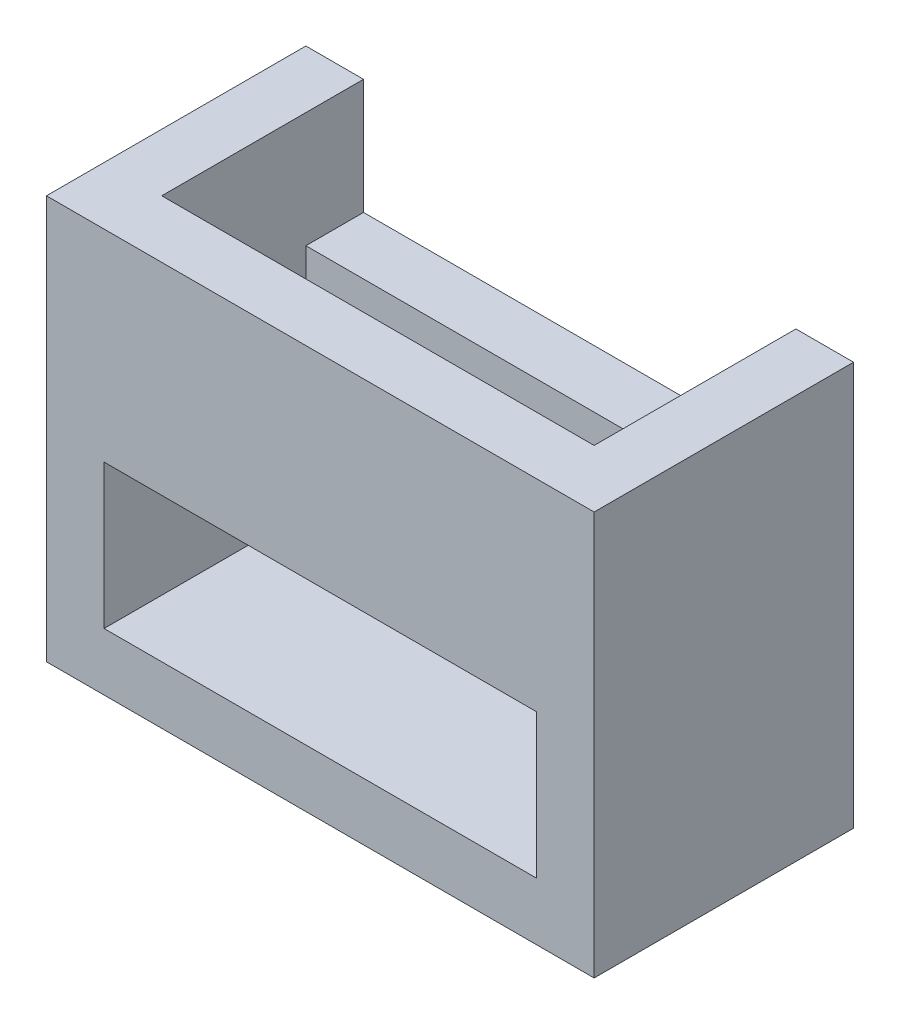
ISO-10303-21;
HEADER;
FILE_DESCRIPTION(('STEP AP214'),'2;1');
FILE_NAME('part.step','',(''),(''),'','','');
FILE_SCHEMA(('AUTOMOTIVE_DESIGN { 1 0 10303 214 1 1 1 1 }'));
ENDSEC;
DATA;
#1=APPLICATION_CONTEXT('core data for automotive mechanical design processes');
#2=APPLICATION_PROTOCOL_DEFINITION('international standard','automotive_design',2000,#1);
#3=PRODUCT_CONTEXT('',#1,'mechanical');
#4=PRODUCT('Part','Part','',(#3));
#5=PRODUCT_RELATED_PRODUCT_CATEGORY('part','',(#4));
#6=PRODUCT_DEFINITION_FORMATION('','',#4);
#7=PRODUCT_DEFINITION_CONTEXT('part definition',#1,'design');
#8=PRODUCT_DEFINITION('design','',#6,#7);
#9=PRODUCT_DEFINITION_SHAPE('','',#8);
#10=(LENGTH_UNIT() NAMED_UNIT(*) SI_UNIT(.MILLI.,.METRE.));
#11=(NAMED_UNIT(*) PLANE_ANGLE_UNIT() SI_UNIT($,.RADIAN.));
#12=(NAMED_UNIT(*) SI_UNIT($,.STERADIAN.) SOLID_ANGLE_UNIT());
#13=UNCERTAINTY_MEASURE_WITH_UNIT(LENGTH_MEASURE(1.E-05),#10,'distance_accuracy_value','');
#14=(GEOMETRIC_REPRESENTATION_CONTEXT(3) GLOBAL_UNCERTAINTY_ASSIGNED_CONTEXT((#13)) GLOBAL_UNIT_ASSIGNED_CONTEXT((#10,
#11,#12)) REPRESENTATION_CONTEXT('',''));
#15=CARTESIAN_POINT('',(0.,0.,0.));
#16=DIRECTION('',(0.,0.,1.));
#17=DIRECTION('',(1.,0.,0.));
#18=AXIS2_PLACEMENT_3D('',#15,#16,#17);
#19=CARTESIAN_POINT('',(0.,0.,4.));
#20=DIRECTION('',(0.,0.,1.));
#21=DIRECTION('',(1.,0.,0.));
#22=AXIS2_PLACEMENT_3D('',#19,#20,#21);
#23=PLANE('',#22);
#24=DIRECTION('',(0.,1.,0.));
#25=VECTOR('',#24,1.);
#26=CARTESIAN_POINT('',(7.50000000000001,0.,4.));
#27=LINE('',#26,#25);
#28=CARTESIAN_POINT('',(7.50000000000001,-5.,4.));
#29=VERTEX_POINT('',#28);
#30=CARTESIAN_POINT('',(7.50000000000001,-0.999999999999999,4.));
#31=VERTEX_POINT('',#30);
#32=EDGE_CURVE('E194',#29,#31,#27,.T.);
#33=ORIENTED_EDGE('',*,*,#32,.T.);
#34=DIRECTION('',(-1.,0.,0.));
#35=VECTOR('',#34,1.);
#36=CARTESIAN_POINT('',(0.,-0.999999999999999,4.));
#37=LINE('',#36,#35);
#38=CARTESIAN_POINT('',(-7.49999999999999,-0.999999999999999,4.));
#39=VERTEX_POINT('',#38);
#40=EDGE_CURVE('E12',#31,#39,#37,.T.);
#41=ORIENTED_EDGE('',*,*,#40,.T.);
#42=DIRECTION('',(0.,1.,0.));
#43=VECTOR('',#42,1.);
#44=CARTESIAN_POINT('',(-7.49999999999999,0.,4.));
#45=LINE('',#44,#43);
#46=CARTESIAN_POINT('',(-7.49999999999999,-5.,4.));
#47=VERTEX_POINT('',#46);
#48=EDGE_CURVE('E197',#47,#39,#45,.T.);
#49=ORIENTED_EDGE('',*,*,#48,.F.);
#50=DIRECTION('',(1.,0.,0.));
#51=VECTOR('',#50,1.);
#52=CARTESIAN_POINT('',(0.,-5.,4.));
#53=LINE('',#52,#51);
#54=EDGE_CURVE('E191',#47,#29,#53,.T.);
#55=ORIENTED_EDGE('',*,*,#54,.T.);
#56=EDGE_LOOP('',(#33,#41,#49,#55));
#57=FACE_BOUND('',#56,.T.);
#58=ADVANCED_FACE('F42',(#57),#23,.T.);
#59=CARTESIAN_POINT('',(-9.49999999999999,7.,9.));
#60=DIRECTION('',(0.,-1.,0.));
#61=DIRECTION('',(0.,0.,-1.));
#62=AXIS2_PLACEMENT_3D('',#59,#60,#61);
#63=PLANE('',#62);
#64=DIRECTION('',(0.,0.,-1.));
#65=VECTOR('',#64,1.);
#66=CARTESIAN_POINT('',(-7.49999999999999,7.,0.));
#67=LINE('',#66,#65);
#68=CARTESIAN_POINT('',(-7.49999999999999,7.,7.));
#69=VERTEX_POINT('',#68);
#70=CARTESIAN_POINT('',(-7.49999999999999,7.,0.));
#71=VERTEX_POINT('',#70);
#72=EDGE_CURVE('E170',#69,#71,#67,.T.);
#73=ORIENTED_EDGE('',*,*,#72,.T.);
#74=DIRECTION('',(-1.,0.,0.));
#75=VECTOR('',#74,1.);
#76=CARTESIAN_POINT('',(-9.49999999999999,7.,0.));
#77=LINE('',#76,#75);
#78=CARTESIAN_POINT('',(-9.49999999999999,7.,0.));
#79=VERTEX_POINT('',#78);
#80=EDGE_CURVE('E232',#71,#79,#77,.T.);
#81=ORIENTED_EDGE('',*,*,#80,.T.);
#82=DIRECTION('',(0.,0.,-1.));
#83=VECTOR('',#82,1.);
#84=CARTESIAN_POINT('',(-9.49999999999999,7.,9.));
#85=LINE('',#84,#83);
#86=CARTESIAN_POINT('',(-9.49999999999999,7.,9.));
#87=VERTEX_POINT('',#86);
#88=EDGE_CURVE('E244',#87,#79,#85,.T.);
#89=ORIENTED_EDGE('',*,*,#88,.F.);
#90=DIRECTION('',(-1.,0.,0.));
#91=VECTOR('',#90,1.);
#92=CARTESIAN_POINT('',(-9.49999999999999,7.,9.));
#93=LINE('',#92,#91);
#94=CARTESIAN_POINT('',(9.50000000000001,7.,9.));
#95=VERTEX_POINT('',#94);
#96=EDGE_CURVE('E222',#95,#87,#93,.T.);
#97=ORIENTED_EDGE('',*,*,#96,.F.);
#98=DIRECTION('',(0.,0.,-1.));
#99=VECTOR('',#98,1.);
#100=CARTESIAN_POINT('',(9.50000000000001,7.,9.));
#101=LINE('',#100,#99);
#102=CARTESIAN_POINT('',(9.50000000000001,7.,0.));
#103=VERTEX_POINT('',#102);
#104=EDGE_CURVE('E50',#95,#103,#101,.T.);
#105=ORIENTED_EDGE('',*,*,#104,.T.);
#106=CARTESIAN_POINT('',(7.50000000000001,7.,0.));
#107=VERTEX_POINT('',#106);
#108=EDGE_CURVE('E233',#103,#107,#77,.T.);
#109=ORIENTED_EDGE('',*,*,#108,.T.);
#110=DIRECTION('',(0.,0.,-1.));
#111=VECTOR('',#110,1.);
#112=CARTESIAN_POINT('',(7.50000000000001,7.,0.));
#113=LINE('',#112,#111);
#114=CARTESIAN_POINT('',(7.50000000000001,7.,7.));
#115=VERTEX_POINT('',#114);
#116=EDGE_CURVE('E178',#115,#107,#113,.T.);
#117=ORIENTED_EDGE('',*,*,#116,.F.);
#118=DIRECTION('',(1.,0.,0.));
#119=VECTOR('',#118,1.);
#120=CARTESIAN_POINT('',(0.,7.,7.));
#121=LINE('',#120,#119);
#122=EDGE_CURVE('E167',#69,#115,#121,.T.);
#123=ORIENTED_EDGE('',*,*,#122,.F.);
#124=EDGE_LOOP('',(#73,#81,#89,#97,#105,#109,#117,#123));
#125=FACE_BOUND('',#124,.T.);
#126=ADVANCED_FACE('F249',(#125),#63,.F.);
#127=CARTESIAN_POINT('',(0.,0.,0.));
#128=DIRECTION('',(0.,0.,1.));
#129=DIRECTION('',(1.,0.,0.));
#130=AXIS2_PLACEMENT_3D('',#127,#128,#129);
#131=PLANE('',#130);
#132=DIRECTION('',(0.,1.,0.));
#133=VECTOR('',#132,1.);
#134=CARTESIAN_POINT('',(-7.49999999999999,3.,0.));
#135=LINE('',#134,#133);
#136=CARTESIAN_POINT('',(-7.49999999999999,3.,0.));
#137=VERTEX_POINT('',#136);
#138=EDGE_CURVE('E185',#137,#71,#135,.T.);
#139=ORIENTED_EDGE('',*,*,#138,.F.);
#140=DIRECTION('',(-1.,0.,0.));
#141=VECTOR('',#140,1.);
#142=CARTESIAN_POINT('',(0.,3.,0.));
#143=LINE('',#142,#141);
#144=CARTESIAN_POINT('',(7.50000000000001,3.,0.));
#145=VERTEX_POINT('',#144);
#146=EDGE_CURVE('E169',#145,#137,#143,.T.);
#147=ORIENTED_EDGE('',*,*,#146,.F.);
#148=DIRECTION('',(0.,1.,0.));
#149=VECTOR('',#148,1.);
#150=CARTESIAN_POINT('',(7.50000000000001,3.,0.));
#151=LINE('',#150,#149);
#152=EDGE_CURVE('E187',#145,#107,#151,.T.);
#153=ORIENTED_EDGE('',*,*,#152,.T.);
#154=ORIENTED_EDGE('',*,*,#108,.F.);
#155=DIRECTION('',(0.,1.,0.));
#156=VECTOR('',#155,1.);
#157=CARTESIAN_POINT('',(9.50000000000001,7.,0.));
#158=LINE('',#157,#156);
#159=CARTESIAN_POINT('',(9.50000000000001,-7.,0.));
#160=VERTEX_POINT('',#159);
#161=EDGE_CURVE('E212',#160,#103,#158,.T.);
#162=ORIENTED_EDGE('',*,*,#161,.F.);
#163=DIRECTION('',(1.,0.,0.));
#164=VECTOR('',#163,1.);
#165=CARTESIAN_POINT('',(-9.49999999999999,-7.,0.));
#166=LINE('',#165,#164);
#167=CARTESIAN_POINT('',(-9.49999999999999,-7.,0.));
#168=VERTEX_POINT('',#167);
#169=EDGE_CURVE('E223',#168,#160,#166,.T.);
#170=ORIENTED_EDGE('',*,*,#169,.F.);
#171=DIRECTION('',(0.,-1.,0.));
#172=VECTOR('',#171,1.);
#173=CARTESIAN_POINT('',(-9.49999999999999,7.,0.));
#174=LINE('',#173,#172);
#175=EDGE_CURVE('E236',#79,#168,#174,.T.);
#176=ORIENTED_EDGE('',*,*,#175,.F.);
#177=ORIENTED_EDGE('',*,*,#80,.F.);
#178=EDGE_LOOP('',(#139,#147,#153,#154,#162,#170,#176,#177));
#179=FACE_BOUND('',#178,.T.);
#180=ADVANCED_FACE('F259',(#179),#131,.F.);
#181=CARTESIAN_POINT('',(9.50000000000001,7.,9.));
#182=DIRECTION('',(-1.,0.,0.));
#183=DIRECTION('',(0.,-1.,0.));
#184=AXIS2_PLACEMENT_3D('',#181,#182,#183);
#185=PLANE('',#184);
#186=ORIENTED_EDGE('',*,*,#161,.T.);
#187=ORIENTED_EDGE('',*,*,#104,.F.);
#188=DIRECTION('',(0.,1.,0.));
#189=VECTOR('',#188,1.);
#190=CARTESIAN_POINT('',(9.50000000000001,7.,9.));
#191=LINE('',#190,#189);
#192=CARTESIAN_POINT('',(9.50000000000001,-7.,9.));
#193=VERTEX_POINT('',#192);
#194=EDGE_CURVE('E219',#193,#95,#191,.T.);
#195=ORIENTED_EDGE('',*,*,#194,.F.);
#196=DIRECTION('',(0.,0.,-1.));
#197=VECTOR('',#196,1.);
#198=CARTESIAN_POINT('',(9.50000000000001,-7.,9.));
#199=LINE('',#198,#197);
#200=EDGE_CURVE('E229',#193,#160,#199,.T.);
#201=ORIENTED_EDGE('',*,*,#200,.T.);
#202=EDGE_LOOP('',(#186,#187,#195,#201));
#203=FACE_BOUND('',#202,.T.);
#204=ADVANCED_FACE('F44',(#203),#185,.F.);
#205=CARTESIAN_POINT('',(-9.49999999999999,7.,9.));
#206=DIRECTION('',(1.,0.,0.));
#207=DIRECTION('',(0.,1.,0.));
#208=AXIS2_PLACEMENT_3D('',#205,#206,#207);
#209=PLANE('',#208);
#210=ORIENTED_EDGE('',*,*,#175,.T.);
#211=DIRECTION('',(0.,0.,-1.));
#212=VECTOR('',#211,1.);
#213=CARTESIAN_POINT('',(-9.49999999999999,-7.,9.));
#214=LINE('',#213,#212);
#215=CARTESIAN_POINT('',(-9.49999999999999,-7.,9.));
#216=VERTEX_POINT('',#215);
#217=EDGE_CURVE('E241',#216,#168,#214,.T.);
#218=ORIENTED_EDGE('',*,*,#217,.F.);
#219=DIRECTION('',(0.,-1.,0.));
#220=VECTOR('',#219,1.);
#221=CARTESIAN_POINT('',(-9.49999999999999,7.,9.));
#222=LINE('',#221,#220);
#223=EDGE_CURVE('E225',#87,#216,#222,.T.);
#224=ORIENTED_EDGE('',*,*,#223,.F.);
#225=ORIENTED_EDGE('',*,*,#88,.T.);
#226=EDGE_LOOP('',(#210,#218,#224,#225));
#227=FACE_BOUND('',#226,.T.);
#228=ADVANCED_FACE('F274',(#227),#209,.F.);
#229=CARTESIAN_POINT('',(-9.49999999999999,-7.,9.));
#230=DIRECTION('',(0.,1.,0.));
#231=DIRECTION('',(0.,0.,1.));
#232=AXIS2_PLACEMENT_3D('',#229,#230,#231);
#233=PLANE('',#232);
#234=ORIENTED_EDGE('',*,*,#169,.T.);
#235=ORIENTED_EDGE('',*,*,#200,.F.);
#236=DIRECTION('',(1.,0.,0.));
#237=VECTOR('',#236,1.);
#238=CARTESIAN_POINT('',(-9.49999999999999,-7.,9.));
#239=LINE('',#238,#237);
#240=EDGE_CURVE('E227',#216,#193,#239,.T.);
#241=ORIENTED_EDGE('',*,*,#240,.F.);
#242=ORIENTED_EDGE('',*,*,#217,.T.);
#243=EDGE_LOOP('',(#234,#235,#241,#242));
#244=FACE_BOUND('',#243,.T.);
#245=ADVANCED_FACE('F280',(#244),#233,.F.);
#246=CARTESIAN_POINT('',(0.,0.,9.));
#247=DIRECTION('',(0.,0.,1.));
#248=DIRECTION('',(1.,0.,0.));
#249=AXIS2_PLACEMENT_3D('',#246,#247,#248);
#250=PLANE('',#249);
#251=DIRECTION('',(1.,0.,0.));
#252=VECTOR('',#251,1.);
#253=CARTESIAN_POINT('',(0.,-5.,9.));
#254=LINE('',#253,#252);
#255=CARTESIAN_POINT('',(-7.49999999999999,-5.,9.));
#256=VERTEX_POINT('',#255);
#257=CARTESIAN_POINT('',(7.50000000000001,-5.,9.));
#258=VERTEX_POINT('',#257);
#259=EDGE_CURVE('E184',#256,#258,#254,.T.);
#260=ORIENTED_EDGE('',*,*,#259,.F.);
#261=DIRECTION('',(0.,1.,0.));
#262=VECTOR('',#261,1.);
#263=CARTESIAN_POINT('',(-7.49999999999999,0.,9.));
#264=LINE('',#263,#262);
#265=CARTESIAN_POINT('',(-7.49999999999999,0.,9.));
#266=VERTEX_POINT('',#265);
#267=EDGE_CURVE('E195',#256,#266,#264,.T.);
#268=ORIENTED_EDGE('',*,*,#267,.T.);
#269=DIRECTION('',(1.,0.,0.));
#270=VECTOR('',#269,1.);
#271=CARTESIAN_POINT('',(0.,0.,9.));
#272=LINE('',#271,#270);
#273=CARTESIAN_POINT('',(7.50000000000001,0.,9.));
#274=VERTEX_POINT('',#273);
#275=EDGE_CURVE('E205',#266,#274,#272,.T.);
#276=ORIENTED_EDGE('',*,*,#275,.T.);
#277=DIRECTION('',(0.,1.,0.));
#278=VECTOR('',#277,1.);
#279=CARTESIAN_POINT('',(7.50000000000001,0.,9.));
#280=LINE('',#279,#278);
#281=EDGE_CURVE('E202',#258,#274,#280,.T.);
#282=ORIENTED_EDGE('',*,*,#281,.F.);
#283=EDGE_LOOP('',(#260,#268,#276,#282));
#284=FACE_BOUND('',#283,.T.);
#285=ORIENTED_EDGE('',*,*,#194,.T.);
#286=ORIENTED_EDGE('',*,*,#96,.T.);
#287=ORIENTED_EDGE('',*,*,#223,.T.);
#288=ORIENTED_EDGE('',*,*,#240,.T.);
#289=EDGE_LOOP('',(#285,#286,#287,#288));
#290=FACE_BOUND('',#289,.T.);
#291=ADVANCED_FACE('F278',(#284,#290),#250,.T.);
#292=CARTESIAN_POINT('',(0.,-5.,4.));
#293=DIRECTION('',(0.,-1.,0.));
#294=DIRECTION('',(0.,0.,-1.));
#295=AXIS2_PLACEMENT_3D('',#292,#293,#294);
#296=PLANE('',#295);
#297=ORIENTED_EDGE('',*,*,#259,.T.);
#298=DIRECTION('',(0.,0.,1.));
#299=VECTOR('',#298,1.);
#300=CARTESIAN_POINT('',(7.50000000000001,-5.,4.));
#301=LINE('',#300,#299);
#302=EDGE_CURVE('E200',#29,#258,#301,.T.);
#303=ORIENTED_EDGE('',*,*,#302,.F.);
#304=ORIENTED_EDGE('',*,*,#54,.F.);
#305=DIRECTION('',(0.,0.,1.));
#306=VECTOR('',#305,1.);
#307=CARTESIAN_POINT('',(-7.49999999999999,-5.,4.));
#308=LINE('',#307,#306);
#309=EDGE_CURVE('E210',#47,#256,#308,.T.);
#310=ORIENTED_EDGE('',*,*,#309,.T.);
#311=EDGE_LOOP('',(#297,#303,#304,#310));
#312=FACE_BOUND('',#311,.T.);
#313=ADVANCED_FACE('F286',(#312),#296,.F.);
#314=CARTESIAN_POINT('',(-7.49999999999999,0.,4.));
#315=DIRECTION('',(1.,0.,0.));
#316=DIRECTION('',(0.,0.,-1.));
#317=AXIS2_PLACEMENT_3D('',#314,#315,#316);
#318=PLANE('',#317);
#319=DIRECTION('',(0.,1.,0.));
#320=VECTOR('',#319,1.);
#321=CARTESIAN_POINT('',(-7.49999999999999,3.,7.));
#322=LINE('',#321,#320);
#323=CARTESIAN_POINT('',(-7.49999999999999,0.,7.));
#324=VERTEX_POINT('',#323);
#325=EDGE_CURVE('E182',#324,#69,#322,.T.);
#326=ORIENTED_EDGE('',*,*,#325,.F.);
#327=DIRECTION('',(0.,0.,1.));
#328=VECTOR('',#327,1.);
#329=CARTESIAN_POINT('',(-7.49999999999999,0.,4.));
#330=LINE('',#329,#328);
#331=EDGE_CURVE('E213',#324,#266,#330,.T.);
#332=ORIENTED_EDGE('',*,*,#331,.T.);
#333=ORIENTED_EDGE('',*,*,#267,.F.);
#334=ORIENTED_EDGE('',*,*,#309,.F.);
#335=ORIENTED_EDGE('',*,*,#48,.T.);
#336=DIRECTION('',(0.,0.,1.));
#337=VECTOR('',#336,1.);
#338=CARTESIAN_POINT('',(-7.49999999999999,-0.999999999999999,0.));
#339=LINE('',#338,#337);
#340=CARTESIAN_POINT('',(-7.49999999999999,-0.999999999999999,2.));
#341=VERTEX_POINT('',#340);
#342=EDGE_CURVE('E57',#341,#39,#339,.T.);
#343=ORIENTED_EDGE('',*,*,#342,.F.);
#344=DIRECTION('',(0.,1.,0.));
#345=VECTOR('',#344,1.);
#346=CARTESIAN_POINT('',(-7.49999999999999,-0.999999999999999,2.));
#347=LINE('',#346,#345);
#348=CARTESIAN_POINT('',(-7.49999999999999,3.,2.));
#349=VERTEX_POINT('',#348);
#350=EDGE_CURVE('E156',#341,#349,#347,.T.);
#351=ORIENTED_EDGE('',*,*,#350,.T.);
#352=DIRECTION('',(0.,0.,-1.));
#353=VECTOR('',#352,1.);
#354=CARTESIAN_POINT('',(-7.49999999999999,3.,0.));
#355=LINE('',#354,#353);
#356=EDGE_CURVE('E173',#349,#137,#355,.T.);
#357=ORIENTED_EDGE('',*,*,#356,.T.);
#358=ORIENTED_EDGE('',*,*,#138,.T.);
#359=ORIENTED_EDGE('',*,*,#72,.F.);
#360=EDGE_LOOP('',(#326,#332,#333,#334,#335,#343,#351,#357,#358,#359));
#361=FACE_BOUND('',#360,.T.);
#362=ADVANCED_FACE('F270',(#361),#318,.T.);
#363=CARTESIAN_POINT('',(0.,0.,4.));
#364=DIRECTION('',(0.,-1.,0.));
#365=DIRECTION('',(0.,0.,-1.));
#366=AXIS2_PLACEMENT_3D('',#363,#364,#365);
#367=PLANE('',#366);
#368=DIRECTION('',(-1.,0.,0.));
#369=VECTOR('',#368,1.);
#370=CARTESIAN_POINT('',(0.,0.,7.));
#371=LINE('',#370,#369);
#372=CARTESIAN_POINT('',(7.50000000000001,0.,7.));
#373=VERTEX_POINT('',#372);
#374=EDGE_CURVE('E163',#373,#324,#371,.T.);
#375=ORIENTED_EDGE('',*,*,#374,.F.);
#376=DIRECTION('',(0.,0.,1.));
#377=VECTOR('',#376,1.);
#378=CARTESIAN_POINT('',(7.50000000000001,0.,4.));
#379=LINE('',#378,#377);
#380=EDGE_CURVE('E215',#373,#274,#379,.T.);
#381=ORIENTED_EDGE('',*,*,#380,.T.);
#382=ORIENTED_EDGE('',*,*,#275,.F.);
#383=ORIENTED_EDGE('',*,*,#331,.F.);
#384=EDGE_LOOP('',(#375,#381,#382,#383));
#385=FACE_BOUND('',#384,.T.);
#386=ADVANCED_FACE('F303',(#385),#367,.T.);
#387=CARTESIAN_POINT('',(7.50000000000001,0.,4.));
#388=DIRECTION('',(1.,0.,0.));
#389=DIRECTION('',(0.,0.,-1.));
#390=AXIS2_PLACEMENT_3D('',#387,#388,#389);
#391=PLANE('',#390);
#392=ORIENTED_EDGE('',*,*,#380,.F.);
#393=DIRECTION('',(0.,1.,0.));
#394=VECTOR('',#393,1.);
#395=CARTESIAN_POINT('',(7.50000000000001,3.,7.));
#396=LINE('',#395,#394);
#397=EDGE_CURVE('E175',#373,#115,#396,.T.);
#398=ORIENTED_EDGE('',*,*,#397,.T.);
#399=ORIENTED_EDGE('',*,*,#116,.T.);
#400=ORIENTED_EDGE('',*,*,#152,.F.);
#401=DIRECTION('',(0.,0.,-1.));
#402=VECTOR('',#401,1.);
#403=CARTESIAN_POINT('',(7.50000000000001,3.,0.));
#404=LINE('',#403,#402);
#405=CARTESIAN_POINT('',(7.50000000000001,3.,2.));
#406=VERTEX_POINT('',#405);
#407=EDGE_CURVE('E155',#406,#145,#404,.T.);
#408=ORIENTED_EDGE('',*,*,#407,.F.);
#409=DIRECTION('',(0.,1.,0.));
#410=VECTOR('',#409,1.);
#411=CARTESIAN_POINT('',(7.50000000000001,-0.999999999999999,2.));
#412=LINE('',#411,#410);
#413=CARTESIAN_POINT('',(7.50000000000001,-0.999999999999999,2.));
#414=VERTEX_POINT('',#413);
#415=EDGE_CURVE('E64',#414,#406,#412,.T.);
#416=ORIENTED_EDGE('',*,*,#415,.F.);
#417=DIRECTION('',(0.,0.,-1.));
#418=VECTOR('',#417,1.);
#419=CARTESIAN_POINT('',(7.50000000000001,-0.999999999999999,0.));
#420=LINE('',#419,#418);
#421=EDGE_CURVE('E143',#31,#414,#420,.T.);
#422=ORIENTED_EDGE('',*,*,#421,.F.);
#423=ORIENTED_EDGE('',*,*,#32,.F.);
#424=ORIENTED_EDGE('',*,*,#302,.T.);
#425=ORIENTED_EDGE('',*,*,#281,.T.);
#426=EDGE_LOOP('',(#392,#398,#399,#400,#408,#416,#422,#423,#424,#425));
#427=FACE_BOUND('',#426,.T.);
#428=ADVANCED_FACE('F153',(#427),#391,.F.);
#429=CARTESIAN_POINT('',(0.,3.,7.));
#430=DIRECTION('',(0.,0.,1.));
#431=DIRECTION('',(1.,0.,0.));
#432=AXIS2_PLACEMENT_3D('',#429,#430,#431);
#433=PLANE('',#432);
#434=ORIENTED_EDGE('',*,*,#122,.T.);
#435=ORIENTED_EDGE('',*,*,#397,.F.);
#436=ORIENTED_EDGE('',*,*,#374,.T.);
#437=ORIENTED_EDGE('',*,*,#325,.T.);
#438=EDGE_LOOP('',(#434,#435,#436,#437));
#439=FACE_BOUND('',#438,.T.);
#440=ADVANCED_FACE('F266',(#439),#433,.F.);
#441=CARTESIAN_POINT('',(0.,3.,0.));
#442=DIRECTION('',(0.,1.,0.));
#443=DIRECTION('',(0.,0.,1.));
#444=AXIS2_PLACEMENT_3D('',#441,#442,#443);
#445=PLANE('',#444);
#446=DIRECTION('',(-1.,0.,0.));
#447=VECTOR('',#446,1.);
#448=CARTESIAN_POINT('',(0.,3.,2.));
#449=LINE('',#448,#447);
#450=EDGE_CURVE('E149',#406,#349,#449,.T.);
#451=ORIENTED_EDGE('',*,*,#450,.F.);
#452=ORIENTED_EDGE('',*,*,#407,.T.);
#453=ORIENTED_EDGE('',*,*,#146,.T.);
#454=ORIENTED_EDGE('',*,*,#356,.F.);
#455=EDGE_LOOP('',(#451,#452,#453,#454));
#456=FACE_BOUND('',#455,.T.);
#457=ADVANCED_FACE('F394',(#456),#445,.T.);
#458=CARTESIAN_POINT('',(0.,-0.999999999999999,2.));
#459=DIRECTION('',(0.,0.,-1.));
#460=DIRECTION('',(-1.,0.,0.));
#461=AXIS2_PLACEMENT_3D('',#458,#459,#460);
#462=PLANE('',#461);
#463=ORIENTED_EDGE('',*,*,#450,.T.);
#464=ORIENTED_EDGE('',*,*,#350,.F.);
#465=DIRECTION('',(-1.,0.,0.));
#466=VECTOR('',#465,1.);
#467=CARTESIAN_POINT('',(0.,-0.999999999999999,2.));
#468=LINE('',#467,#466);
#469=EDGE_CURVE('E145',#414,#341,#468,.T.);
#470=ORIENTED_EDGE('',*,*,#469,.F.);
#471=ORIENTED_EDGE('',*,*,#415,.T.);
#472=EDGE_LOOP('',(#463,#464,#470,#471));
#473=FACE_BOUND('',#472,.T.);
#474=ADVANCED_FACE('F158',(#473),#462,.F.);
#475=CARTESIAN_POINT('',(0.,-0.999999999999999,0.));
#476=DIRECTION('',(0.,1.,0.));
#477=DIRECTION('',(0.,0.,1.));
#478=AXIS2_PLACEMENT_3D('',#475,#476,#477);
#479=PLANE('',#478);
#480=ORIENTED_EDGE('',*,*,#421,.T.);
#481=ORIENTED_EDGE('',*,*,#469,.T.);
#482=ORIENTED_EDGE('',*,*,#342,.T.);
#483=ORIENTED_EDGE('',*,*,#40,.F.);
#484=EDGE_LOOP('',(#480,#481,#482,#483));
#485=FACE_BOUND('',#484,.T.);
#486=ADVANCED_FACE('F144',(#485),#479,.T.);
#487=CLOSED_SHELL('',(#58,#126,#180,#204,#228,#245,#291,#313,#362,#386,#428,#440,#457,#474,#486));
#488=MANIFOLD_SOLID_BREP('B2',#487);
#489=ADVANCED_BREP_SHAPE_REPRESENTATION('',(#18,#488),#14);
#490=SHAPE_DEFINITION_REPRESENTATION(#9,#489);
ENDSEC;
END-ISO-10303-21;
